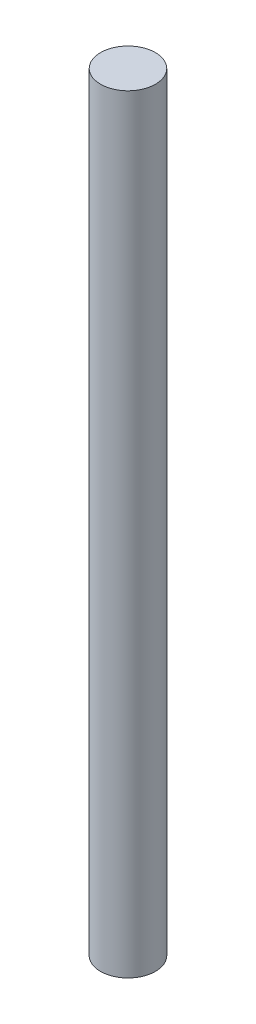
ISO-10303-21;
HEADER;
FILE_DESCRIPTION(('STEP AP214'),'2;1');
FILE_NAME('part.step','',(''),(''),'','','');
FILE_SCHEMA(('AUTOMOTIVE_DESIGN { 1 0 10303 214 1 1 1 1 }'));
ENDSEC;
DATA;
#1=APPLICATION_CONTEXT('core data for automotive mechanical design processes');
#2=APPLICATION_PROTOCOL_DEFINITION('international standard','automotive_design',2000,#1);
#3=PRODUCT_CONTEXT('',#1,'mechanical');
#4=PRODUCT('Part','Part','',(#3));
#5=PRODUCT_RELATED_PRODUCT_CATEGORY('part','',(#4));
#6=PRODUCT_DEFINITION_FORMATION('','',#4);
#7=PRODUCT_DEFINITION_CONTEXT('part definition',#1,'design');
#8=PRODUCT_DEFINITION('design','',#6,#7);
#9=PRODUCT_DEFINITION_SHAPE('','',#8);
#10=(LENGTH_UNIT() NAMED_UNIT(*) SI_UNIT(.MILLI.,.METRE.));
#11=(NAMED_UNIT(*) PLANE_ANGLE_UNIT() SI_UNIT($,.RADIAN.));
#12=(NAMED_UNIT(*) SI_UNIT($,.STERADIAN.) SOLID_ANGLE_UNIT());
#13=UNCERTAINTY_MEASURE_WITH_UNIT(LENGTH_MEASURE(1.E-05),#10,'distance_accuracy_value','');
#14=(GEOMETRIC_REPRESENTATION_CONTEXT(3) GLOBAL_UNCERTAINTY_ASSIGNED_CONTEXT((#13)) GLOBAL_UNIT_ASSIGNED_CONTEXT((#10,
#11,#12)) REPRESENTATION_CONTEXT('',''));
#15=CARTESIAN_POINT('',(0.,0.,0.));
#16=DIRECTION('',(0.,0.,1.));
#17=DIRECTION('',(1.,0.,0.));
#18=AXIS2_PLACEMENT_3D('',#15,#16,#17);
#19=CARTESIAN_POINT('',(0.,177.8,0.));
#20=DIRECTION('',(0.,-1.,0.));
#21=DIRECTION('',(0.,0.,-1.));
#22=AXIS2_PLACEMENT_3D('',#19,#20,#21);
#23=CYLINDRICAL_SURFACE('',#22,6.35);
#24=CARTESIAN_POINT('',(0.,177.8,0.));
#25=DIRECTION('',(0.,1.,0.));
#26=DIRECTION('',(0.,0.,1.));
#27=AXIS2_PLACEMENT_3D('',#24,#25,#26);
#28=CIRCLE('',#27,6.35);
#29=CARTESIAN_POINT('',(0.,177.8,6.35));
#30=VERTEX_POINT('',#29);
#31=EDGE_CURVE('E10',#30,#30,#28,.T.);
#32=ORIENTED_EDGE('',*,*,#31,.F.);
#33=EDGE_LOOP('',(#32));
#34=FACE_BOUND('',#33,.T.);
#35=CARTESIAN_POINT('',(0.,0.,0.));
#36=DIRECTION('',(0.,1.,0.));
#37=DIRECTION('',(0.,0.,1.));
#38=AXIS2_PLACEMENT_3D('',#35,#36,#37);
#39=CIRCLE('',#38,6.35);
#40=CARTESIAN_POINT('',(0.,0.,6.35));
#41=VERTEX_POINT('',#40);
#42=EDGE_CURVE('E34',#41,#41,#39,.T.);
#43=ORIENTED_EDGE('',*,*,#42,.T.);
#44=EDGE_LOOP('',(#43));
#45=FACE_BOUND('',#44,.T.);
#46=ADVANCED_FACE('F31',(#34,#45),#23,.T.);
#47=CARTESIAN_POINT('',(0.,177.8,0.));
#48=DIRECTION('',(0.,1.,0.));
#49=DIRECTION('',(0.,0.,1.));
#50=AXIS2_PLACEMENT_3D('',#47,#48,#49);
#51=PLANE('',#50);
#52=ORIENTED_EDGE('',*,*,#31,.T.);
#53=EDGE_LOOP('',(#52));
#54=FACE_BOUND('',#53,.T.);
#55=ADVANCED_FACE('F46',(#54),#51,.T.);
#56=CARTESIAN_POINT('',(0.,0.,0.));
#57=DIRECTION('',(0.,1.,0.));
#58=DIRECTION('',(0.,0.,1.));
#59=AXIS2_PLACEMENT_3D('',#56,#57,#58);
#60=PLANE('',#59);
#61=ORIENTED_EDGE('',*,*,#42,.F.);
#62=EDGE_LOOP('',(#61));
#63=FACE_BOUND('',#62,.T.);
#64=ADVANCED_FACE('F44',(#63),#60,.F.);
#65=CLOSED_SHELL('',(#46,#55,#64));
#66=MANIFOLD_SOLID_BREP('B2',#65);
#67=ADVANCED_BREP_SHAPE_REPRESENTATION('',(#18,#66),#14);
#68=SHAPE_DEFINITION_REPRESENTATION(#9,#67);
ENDSEC;
END-ISO-10303-21;
